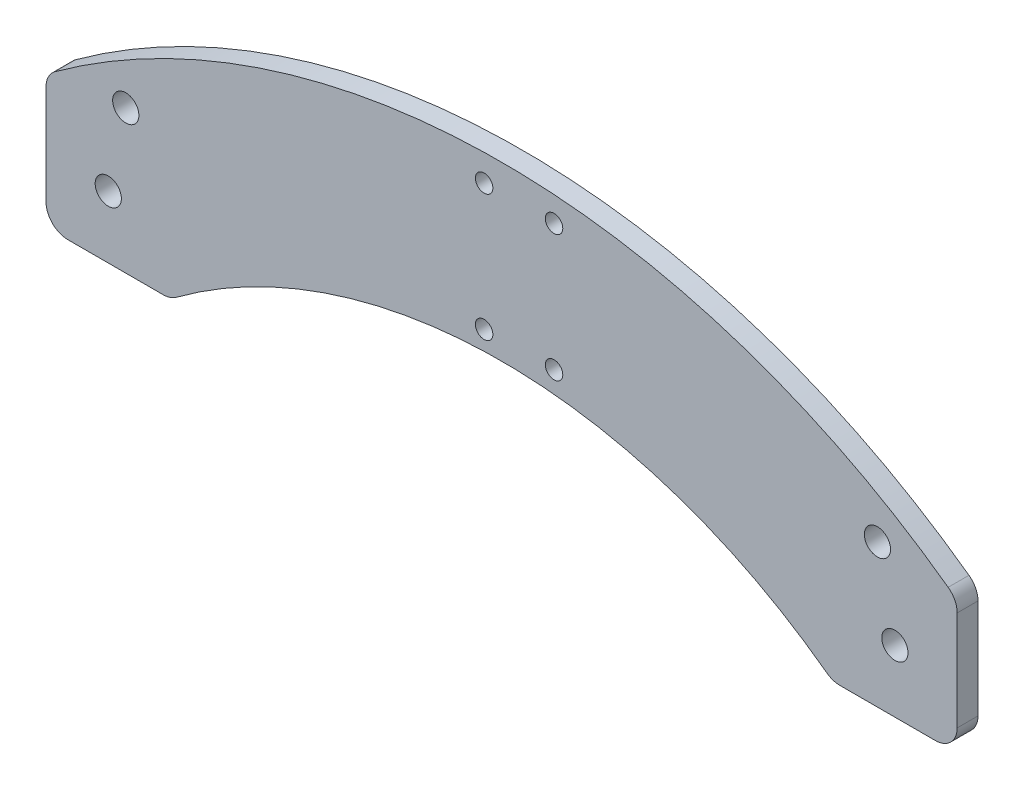
ISO-10303-21;
HEADER;
FILE_DESCRIPTION(('STEP AP214'),'2;1');
FILE_NAME('part.step','',(''),(''),'','','');
FILE_SCHEMA(('AUTOMOTIVE_DESIGN { 1 0 10303 214 1 1 1 1 }'));
ENDSEC;
DATA;
#1=APPLICATION_CONTEXT('core data for automotive mechanical design processes');
#2=APPLICATION_PROTOCOL_DEFINITION('international standard','automotive_design',2000,#1);
#3=PRODUCT_CONTEXT('',#1,'mechanical');
#4=PRODUCT('Part','Part','',(#3));
#5=PRODUCT_RELATED_PRODUCT_CATEGORY('part','',(#4));
#6=PRODUCT_DEFINITION_FORMATION('','',#4);
#7=PRODUCT_DEFINITION_CONTEXT('part definition',#1,'design');
#8=PRODUCT_DEFINITION('design','',#6,#7);
#9=PRODUCT_DEFINITION_SHAPE('','',#8);
#10=(LENGTH_UNIT() NAMED_UNIT(*) SI_UNIT(.MILLI.,.METRE.));
#11=(NAMED_UNIT(*) PLANE_ANGLE_UNIT() SI_UNIT($,.RADIAN.));
#12=(NAMED_UNIT(*) SI_UNIT($,.STERADIAN.) SOLID_ANGLE_UNIT());
#13=UNCERTAINTY_MEASURE_WITH_UNIT(LENGTH_MEASURE(1.E-05),#10,'distance_accuracy_value','');
#14=(GEOMETRIC_REPRESENTATION_CONTEXT(3) GLOBAL_UNCERTAINTY_ASSIGNED_CONTEXT((#13)) GLOBAL_UNIT_ASSIGNED_CONTEXT((#10,
#11,#12)) REPRESENTATION_CONTEXT('',''));
#15=CARTESIAN_POINT('',(0.,0.,0.));
#16=DIRECTION('',(0.,0.,1.));
#17=DIRECTION('',(1.,0.,0.));
#18=AXIS2_PLACEMENT_3D('',#15,#16,#17);
#19=CARTESIAN_POINT('',(-9.24999999999999,13.5361012676361,4.7625));
#20=DIRECTION('',(0.,0.,1.));
#21=DIRECTION('',(1.,0.,0.));
#22=AXIS2_PLACEMENT_3D('',#19,#20,#21);
#23=PLANE('',#22);
#24=CARTESIAN_POINT('',(4.,18.5000000000001,4.7625));
#25=DIRECTION('',(0.,0.,1.));
#26=DIRECTION('',(1.,0.,0.));
#27=AXIS2_PLACEMENT_3D('',#24,#25,#26);
#28=CIRCLE('',#27,3.00000000000229);
#29=CARTESIAN_POINT('',(7.00000000000228,18.5000000000001,4.7625));
#30=VERTEX_POINT('',#29);
#31=EDGE_CURVE('E308',#30,#30,#28,.T.);
#32=ORIENTED_EDGE('',*,*,#31,.F.);
#33=EDGE_LOOP('',(#32));
#34=FACE_BOUND('',#33,.T.);
#35=CARTESIAN_POINT('',(180.,2.10499963540171E-13,4.7625));
#36=DIRECTION('',(0.,0.,1.));
#37=DIRECTION('',(1.,0.,0.));
#38=AXIS2_PLACEMENT_3D('',#35,#36,#37);
#39=CIRCLE('',#38,3.00000000000018);
#40=CARTESIAN_POINT('',(183.,2.10499963540171E-13,4.7625));
#41=VERTEX_POINT('',#40);
#42=EDGE_CURVE('E320',#41,#41,#39,.T.);
#43=ORIENTED_EDGE('',*,*,#42,.F.);
#44=EDGE_LOOP('',(#43));
#45=FACE_BOUND('',#44,.T.);
#46=CARTESIAN_POINT('',(102.,44.6000000000001,4.7625));
#47=DIRECTION('',(0.,0.,1.));
#48=DIRECTION('',(1.,0.,0.));
#49=AXIS2_PLACEMENT_3D('',#46,#47,#48);
#50=CIRCLE('',#49,2.);
#51=CARTESIAN_POINT('',(104.,44.6000000000001,4.7625));
#52=VERTEX_POINT('',#51);
#53=EDGE_CURVE('E332',#52,#52,#50,.T.);
#54=ORIENTED_EDGE('',*,*,#53,.F.);
#55=EDGE_LOOP('',(#54));
#56=FACE_BOUND('',#55,.T.);
#57=CARTESIAN_POINT('',(86.,44.6000000000001,4.7625));
#58=DIRECTION('',(0.,0.,1.));
#59=DIRECTION('',(1.,0.,0.));
#60=AXIS2_PLACEMENT_3D('',#57,#58,#59);
#61=CIRCLE('',#60,2.);
#62=CARTESIAN_POINT('',(88.,44.6000000000001,4.7625));
#63=VERTEX_POINT('',#62);
#64=EDGE_CURVE('E158',#63,#63,#61,.T.);
#65=ORIENTED_EDGE('',*,*,#64,.F.);
#66=EDGE_LOOP('',(#65));
#67=FACE_BOUND('',#66,.T.);
#68=CARTESIAN_POINT('',(-9.24999999999999,13.5361012676361,4.7625));
#69=DIRECTION('',(0.,0.,1.));
#70=DIRECTION('',(1.,0.,0.));
#71=AXIS2_PLACEMENT_3D('',#68,#69,#70);
#72=CIRCLE('',#71,5.);
#73=CARTESIAN_POINT('',(-12.1863905325444,17.5830273406431,4.7625));
#74=VERTEX_POINT('',#73);
#75=CARTESIAN_POINT('',(-14.25,13.5361012676361,4.7625));
#76=VERTEX_POINT('',#75);
#77=EDGE_CURVE('E177',#74,#76,#72,.T.);
#78=ORIENTED_EDGE('',*,*,#77,.T.);
#79=DIRECTION('',(0.,-1.,0.));
#80=VECTOR('',#79,1.);
#81=CARTESIAN_POINT('',(-14.25,-9.24999999999996,4.7625));
#82=LINE('',#81,#80);
#83=CARTESIAN_POINT('',(-14.25,-9.24999999999996,4.7625));
#84=VERTEX_POINT('',#83);
#85=EDGE_CURVE('E105',#76,#84,#82,.T.);
#86=ORIENTED_EDGE('',*,*,#85,.T.);
#87=CARTESIAN_POINT('',(-9.24999999999999,-9.24999999999996,4.7625));
#88=DIRECTION('',(0.,0.,1.));
#89=DIRECTION('',(1.,0.,0.));
#90=AXIS2_PLACEMENT_3D('',#87,#88,#89);
#91=CIRCLE('',#90,5.);
#92=CARTESIAN_POINT('',(-9.24999999999999,-14.25,4.7625));
#93=VERTEX_POINT('',#92);
#94=EDGE_CURVE('E204',#84,#93,#91,.T.);
#95=ORIENTED_EDGE('',*,*,#94,.T.);
#96=DIRECTION('',(1.,0.,0.));
#97=VECTOR('',#96,1.);
#98=CARTESIAN_POINT('',(12.5808053846766,-14.25,4.7625));
#99=LINE('',#98,#97);
#100=CARTESIAN_POINT('',(12.5808053846766,-14.25,4.7625));
#101=VERTEX_POINT('',#100);
#102=EDGE_CURVE('E223',#93,#101,#99,.T.);
#103=ORIENTED_EDGE('',*,*,#102,.T.);
#104=CARTESIAN_POINT('',(12.5808053846766,-9.24999999999995,4.7625));
#105=DIRECTION('',(0.,0.,1.));
#106=DIRECTION('',(-1.,0.,0.));
#107=AXIS2_PLACEMENT_3D('',#104,#105,#106);
#108=CIRCLE('',#107,5.00000000000001);
#109=CARTESIAN_POINT('',(15.5584667160352,-13.2666569427487,4.7625));
#110=VERTEX_POINT('',#109);
#111=EDGE_CURVE('E220',#101,#110,#108,.T.);
#112=ORIENTED_EDGE('',*,*,#111,.T.);
#113=CARTESIAN_POINT('',(90.0000000000001,-113.683080511467,4.7625));
#114=DIRECTION('',(0.,0.,-1.));
#115=DIRECTION('',(1.,0.,0.));
#116=AXIS2_PLACEMENT_3D('',#113,#114,#115);
#117=CIRCLE('',#116,125.);
#118=CARTESIAN_POINT('',(164.441533283965,-13.2666569427486,4.7625));
#119=VERTEX_POINT('',#118);
#120=EDGE_CURVE('E222',#110,#119,#117,.T.);
#121=ORIENTED_EDGE('',*,*,#120,.T.);
#122=CARTESIAN_POINT('',(167.419194615324,-9.24999999999983,4.7625));
#123=DIRECTION('',(0.,0.,1.));
#124=DIRECTION('',(-1.,0.,0.));
#125=AXIS2_PLACEMENT_3D('',#122,#123,#124);
#126=CIRCLE('',#125,5.00000000000001);
#127=CARTESIAN_POINT('',(167.419194615324,-14.2499999999998,4.7625));
#128=VERTEX_POINT('',#127);
#129=EDGE_CURVE('E225',#119,#128,#126,.T.);
#130=ORIENTED_EDGE('',*,*,#129,.T.);
#131=DIRECTION('',(1.,0.,0.));
#132=VECTOR('',#131,1.);
#133=CARTESIAN_POINT('',(189.25,-14.2499999999998,4.7625));
#134=LINE('',#133,#132);
#135=CARTESIAN_POINT('',(189.25,-14.2499999999998,4.7625));
#136=VERTEX_POINT('',#135);
#137=EDGE_CURVE('E231',#128,#136,#134,.T.);
#138=ORIENTED_EDGE('',*,*,#137,.T.);
#139=CARTESIAN_POINT('',(189.25,-9.24999999999983,4.7625));
#140=DIRECTION('',(0.,0.,1.));
#141=DIRECTION('',(-1.,0.,0.));
#142=AXIS2_PLACEMENT_3D('',#139,#140,#141);
#143=CIRCLE('',#142,5.);
#144=CARTESIAN_POINT('',(194.25,-9.24999999999983,4.7625));
#145=VERTEX_POINT('',#144);
#146=EDGE_CURVE('E136',#136,#145,#143,.T.);
#147=ORIENTED_EDGE('',*,*,#146,.T.);
#148=DIRECTION('',(0.,1.,0.));
#149=VECTOR('',#148,1.);
#150=CARTESIAN_POINT('',(194.25,13.5361012676362,4.7625));
#151=LINE('',#150,#149);
#152=CARTESIAN_POINT('',(194.25,13.5361012676362,4.7625));
#153=VERTEX_POINT('',#152);
#154=EDGE_CURVE('E130',#145,#153,#151,.T.);
#155=ORIENTED_EDGE('',*,*,#154,.T.);
#156=CARTESIAN_POINT('',(189.25,13.5361012676362,4.7625));
#157=DIRECTION('',(0.,0.,1.));
#158=DIRECTION('',(1.,0.,0.));
#159=AXIS2_PLACEMENT_3D('',#156,#157,#158);
#160=CIRCLE('',#159,5.);
#161=CARTESIAN_POINT('',(192.186390532544,17.5830273406432,4.7625));
#162=VERTEX_POINT('',#161);
#163=EDGE_CURVE('E134',#153,#162,#160,.T.);
#164=ORIENTED_EDGE('',*,*,#163,.T.);
#165=CARTESIAN_POINT('',(90.0000000000001,-123.25,4.7625));
#166=DIRECTION('',(0.,0.,1.));
#167=DIRECTION('',(-1.,0.,0.));
#168=AXIS2_PLACEMENT_3D('',#165,#166,#167);
#169=CIRCLE('',#168,174.);
#170=EDGE_CURVE('E50',#162,#74,#169,.T.);
#171=ORIENTED_EDGE('',*,*,#170,.T.);
#172=EDGE_LOOP('',(#78,#86,#95,#103,#112,#121,#130,#138,#147,#155,#164,#171));
#173=FACE_BOUND('',#172,.T.);
#174=CARTESIAN_POINT('',(86.,15.6000000000001,4.7625));
#175=DIRECTION('',(0.,0.,1.));
#176=DIRECTION('',(1.,0.,0.));
#177=AXIS2_PLACEMENT_3D('',#174,#175,#176);
#178=CIRCLE('',#177,2.);
#179=CARTESIAN_POINT('',(88.,15.6000000000001,4.7625));
#180=VERTEX_POINT('',#179);
#181=EDGE_CURVE('E338',#180,#180,#178,.T.);
#182=ORIENTED_EDGE('',*,*,#181,.F.);
#183=EDGE_LOOP('',(#182));
#184=FACE_BOUND('',#183,.T.);
#185=CARTESIAN_POINT('',(102.,15.6000000000001,4.7625));
#186=DIRECTION('',(0.,0.,1.));
#187=DIRECTION('',(1.,0.,0.));
#188=AXIS2_PLACEMENT_3D('',#185,#186,#187);
#189=CIRCLE('',#188,2.);
#190=CARTESIAN_POINT('',(104.,15.6000000000001,4.7625));
#191=VERTEX_POINT('',#190);
#192=EDGE_CURVE('E326',#191,#191,#189,.T.);
#193=ORIENTED_EDGE('',*,*,#192,.F.);
#194=EDGE_LOOP('',(#193));
#195=FACE_BOUND('',#194,.T.);
#196=CARTESIAN_POINT('',(0.,0.,4.7625));
#197=DIRECTION('',(0.,0.,1.));
#198=DIRECTION('',(1.,0.,0.));
#199=AXIS2_PLACEMENT_3D('',#196,#197,#198);
#200=CIRCLE('',#199,3.);
#201=CARTESIAN_POINT('',(3.,0.,4.7625));
#202=VERTEX_POINT('',#201);
#203=EDGE_CURVE('E314',#202,#202,#200,.T.);
#204=ORIENTED_EDGE('',*,*,#203,.F.);
#205=EDGE_LOOP('',(#204));
#206=FACE_BOUND('',#205,.T.);
#207=CARTESIAN_POINT('',(176.,18.5000000000002,4.7625));
#208=DIRECTION('',(0.,0.,1.));
#209=DIRECTION('',(1.,0.,0.));
#210=AXIS2_PLACEMENT_3D('',#207,#208,#209);
#211=CIRCLE('',#210,2.99999999999999);
#212=CARTESIAN_POINT('',(179.,18.5000000000002,4.7625));
#213=VERTEX_POINT('',#212);
#214=EDGE_CURVE('E299',#213,#213,#211,.T.);
#215=ORIENTED_EDGE('',*,*,#214,.F.);
#216=EDGE_LOOP('',(#215));
#217=FACE_BOUND('',#216,.T.);
#218=ADVANCED_FACE('F33',(#34,#45,#56,#67,#173,#184,#195,#206,#217),#23,.T.);
#219=CARTESIAN_POINT('',(-9.24999999999999,13.5361012676361,0.));
#220=DIRECTION('',(0.,0.,1.));
#221=DIRECTION('',(1.,0.,0.));
#222=AXIS2_PLACEMENT_3D('',#219,#220,#221);
#223=PLANE('',#222);
#224=CARTESIAN_POINT('',(4.,18.5000000000001,0.));
#225=DIRECTION('',(0.,0.,1.));
#226=DIRECTION('',(1.,0.,0.));
#227=AXIS2_PLACEMENT_3D('',#224,#225,#226);
#228=CIRCLE('',#227,3.00000000000229);
#229=CARTESIAN_POINT('',(7.00000000000228,18.5000000000001,0.));
#230=VERTEX_POINT('',#229);
#231=EDGE_CURVE('E305',#230,#230,#228,.T.);
#232=ORIENTED_EDGE('',*,*,#231,.T.);
#233=EDGE_LOOP('',(#232));
#234=FACE_BOUND('',#233,.T.);
#235=CARTESIAN_POINT('',(180.,2.10499963540171E-13,0.));
#236=DIRECTION('',(0.,0.,1.));
#237=DIRECTION('',(1.,0.,0.));
#238=AXIS2_PLACEMENT_3D('',#235,#236,#237);
#239=CIRCLE('',#238,3.00000000000018);
#240=CARTESIAN_POINT('',(183.,2.10499963540171E-13,0.));
#241=VERTEX_POINT('',#240);
#242=EDGE_CURVE('E317',#241,#241,#239,.T.);
#243=ORIENTED_EDGE('',*,*,#242,.T.);
#244=EDGE_LOOP('',(#243));
#245=FACE_BOUND('',#244,.T.);
#246=CARTESIAN_POINT('',(102.,44.6000000000001,0.));
#247=DIRECTION('',(0.,0.,1.));
#248=DIRECTION('',(1.,0.,0.));
#249=AXIS2_PLACEMENT_3D('',#246,#247,#248);
#250=CIRCLE('',#249,2.);
#251=CARTESIAN_POINT('',(104.,44.6000000000001,0.));
#252=VERTEX_POINT('',#251);
#253=EDGE_CURVE('E329',#252,#252,#250,.T.);
#254=ORIENTED_EDGE('',*,*,#253,.T.);
#255=EDGE_LOOP('',(#254));
#256=FACE_BOUND('',#255,.T.);
#257=CARTESIAN_POINT('',(86.,44.6000000000001,0.));
#258=DIRECTION('',(0.,0.,1.));
#259=DIRECTION('',(1.,0.,0.));
#260=AXIS2_PLACEMENT_3D('',#257,#258,#259);
#261=CIRCLE('',#260,2.);
#262=CARTESIAN_POINT('',(88.,44.6000000000001,0.));
#263=VERTEX_POINT('',#262);
#264=EDGE_CURVE('E341',#263,#263,#261,.T.);
#265=ORIENTED_EDGE('',*,*,#264,.T.);
#266=EDGE_LOOP('',(#265));
#267=FACE_BOUND('',#266,.T.);
#268=CARTESIAN_POINT('',(-9.24999999999999,13.5361012676361,0.));
#269=DIRECTION('',(0.,0.,1.));
#270=DIRECTION('',(1.,0.,0.));
#271=AXIS2_PLACEMENT_3D('',#268,#269,#270);
#272=CIRCLE('',#271,5.);
#273=CARTESIAN_POINT('',(-12.1863905325444,17.5830273406431,0.));
#274=VERTEX_POINT('',#273);
#275=CARTESIAN_POINT('',(-14.25,13.5361012676361,0.));
#276=VERTEX_POINT('',#275);
#277=EDGE_CURVE('E154',#274,#276,#272,.T.);
#278=ORIENTED_EDGE('',*,*,#277,.F.);
#279=CARTESIAN_POINT('',(90.0000000000001,-123.25,0.));
#280=DIRECTION('',(0.,0.,1.));
#281=DIRECTION('',(-1.,0.,0.));
#282=AXIS2_PLACEMENT_3D('',#279,#280,#281);
#283=CIRCLE('',#282,174.);
#284=CARTESIAN_POINT('',(192.186390532544,17.5830273406432,0.));
#285=VERTEX_POINT('',#284);
#286=EDGE_CURVE('E97',#285,#274,#283,.T.);
#287=ORIENTED_EDGE('',*,*,#286,.F.);
#288=CARTESIAN_POINT('',(189.25,13.5361012676362,0.));
#289=DIRECTION('',(0.,0.,1.));
#290=DIRECTION('',(1.,0.,0.));
#291=AXIS2_PLACEMENT_3D('',#288,#289,#290);
#292=CIRCLE('',#291,5.);
#293=CARTESIAN_POINT('',(194.25,13.5361012676362,0.));
#294=VERTEX_POINT('',#293);
#295=EDGE_CURVE('E91',#294,#285,#292,.T.);
#296=ORIENTED_EDGE('',*,*,#295,.F.);
#297=DIRECTION('',(0.,1.,0.));
#298=VECTOR('',#297,1.);
#299=CARTESIAN_POINT('',(194.25,13.5361012676362,0.));
#300=LINE('',#299,#298);
#301=CARTESIAN_POINT('',(194.25,-9.24999999999983,0.));
#302=VERTEX_POINT('',#301);
#303=EDGE_CURVE('E144',#302,#294,#300,.T.);
#304=ORIENTED_EDGE('',*,*,#303,.F.);
#305=CARTESIAN_POINT('',(189.25,-9.24999999999983,0.));
#306=DIRECTION('',(0.,0.,1.));
#307=DIRECTION('',(-1.,0.,0.));
#308=AXIS2_PLACEMENT_3D('',#305,#306,#307);
#309=CIRCLE('',#308,5.);
#310=CARTESIAN_POINT('',(189.25,-14.2499999999998,0.));
#311=VERTEX_POINT('',#310);
#312=EDGE_CURVE('E172',#311,#302,#309,.T.);
#313=ORIENTED_EDGE('',*,*,#312,.F.);
#314=DIRECTION('',(1.,0.,0.));
#315=VECTOR('',#314,1.);
#316=CARTESIAN_POINT('',(189.25,-14.2499999999998,0.));
#317=LINE('',#316,#315);
#318=CARTESIAN_POINT('',(167.419194615324,-14.2499999999998,0.));
#319=VERTEX_POINT('',#318);
#320=EDGE_CURVE('E170',#319,#311,#317,.T.);
#321=ORIENTED_EDGE('',*,*,#320,.F.);
#322=CARTESIAN_POINT('',(167.419194615324,-9.24999999999983,0.));
#323=DIRECTION('',(0.,0.,1.));
#324=DIRECTION('',(-1.,0.,0.));
#325=AXIS2_PLACEMENT_3D('',#322,#323,#324);
#326=CIRCLE('',#325,5.00000000000001);
#327=CARTESIAN_POINT('',(164.441533283965,-13.2666569427486,0.));
#328=VERTEX_POINT('',#327);
#329=EDGE_CURVE('E168',#328,#319,#326,.T.);
#330=ORIENTED_EDGE('',*,*,#329,.F.);
#331=CARTESIAN_POINT('',(90.0000000000001,-113.683080511467,0.));
#332=DIRECTION('',(0.,0.,-1.));
#333=DIRECTION('',(1.,0.,0.));
#334=AXIS2_PLACEMENT_3D('',#331,#332,#333);
#335=CIRCLE('',#334,125.);
#336=CARTESIAN_POINT('',(15.5584667160352,-13.2666569427487,0.));
#337=VERTEX_POINT('',#336);
#338=EDGE_CURVE('E166',#337,#328,#335,.T.);
#339=ORIENTED_EDGE('',*,*,#338,.F.);
#340=CARTESIAN_POINT('',(12.5808053846766,-9.24999999999995,0.));
#341=DIRECTION('',(0.,0.,1.));
#342=DIRECTION('',(-1.,0.,0.));
#343=AXIS2_PLACEMENT_3D('',#340,#341,#342);
#344=CIRCLE('',#343,5.00000000000001);
#345=CARTESIAN_POINT('',(12.5808053846766,-14.25,0.));
#346=VERTEX_POINT('',#345);
#347=EDGE_CURVE('E164',#346,#337,#344,.T.);
#348=ORIENTED_EDGE('',*,*,#347,.F.);
#349=DIRECTION('',(1.,0.,0.));
#350=VECTOR('',#349,1.);
#351=CARTESIAN_POINT('',(12.5808053846766,-14.25,0.));
#352=LINE('',#351,#350);
#353=CARTESIAN_POINT('',(-9.24999999999999,-14.25,0.));
#354=VERTEX_POINT('',#353);
#355=EDGE_CURVE('E162',#354,#346,#352,.T.);
#356=ORIENTED_EDGE('',*,*,#355,.F.);
#357=CARTESIAN_POINT('',(-9.24999999999999,-9.24999999999996,0.));
#358=DIRECTION('',(0.,0.,1.));
#359=DIRECTION('',(1.,0.,0.));
#360=AXIS2_PLACEMENT_3D('',#357,#358,#359);
#361=CIRCLE('',#360,5.);
#362=CARTESIAN_POINT('',(-14.25,-9.24999999999996,0.));
#363=VERTEX_POINT('',#362);
#364=EDGE_CURVE('E160',#363,#354,#361,.T.);
#365=ORIENTED_EDGE('',*,*,#364,.F.);
#366=DIRECTION('',(0.,-1.,0.));
#367=VECTOR('',#366,1.);
#368=CARTESIAN_POINT('',(-14.25,-9.24999999999996,0.));
#369=LINE('',#368,#367);
#370=EDGE_CURVE('E157',#276,#363,#369,.T.);
#371=ORIENTED_EDGE('',*,*,#370,.F.);
#372=EDGE_LOOP('',(#278,#287,#296,#304,#313,#321,#330,#339,#348,#356,#365,#371));
#373=FACE_BOUND('',#372,.T.);
#374=CARTESIAN_POINT('',(86.,15.6000000000001,0.));
#375=DIRECTION('',(0.,0.,1.));
#376=DIRECTION('',(1.,0.,0.));
#377=AXIS2_PLACEMENT_3D('',#374,#375,#376);
#378=CIRCLE('',#377,2.);
#379=CARTESIAN_POINT('',(88.,15.6000000000001,0.));
#380=VERTEX_POINT('',#379);
#381=EDGE_CURVE('E335',#380,#380,#378,.T.);
#382=ORIENTED_EDGE('',*,*,#381,.T.);
#383=EDGE_LOOP('',(#382));
#384=FACE_BOUND('',#383,.T.);
#385=CARTESIAN_POINT('',(102.,15.6000000000001,0.));
#386=DIRECTION('',(0.,0.,1.));
#387=DIRECTION('',(1.,0.,0.));
#388=AXIS2_PLACEMENT_3D('',#385,#386,#387);
#389=CIRCLE('',#388,2.);
#390=CARTESIAN_POINT('',(104.,15.6000000000001,0.));
#391=VERTEX_POINT('',#390);
#392=EDGE_CURVE('E323',#391,#391,#389,.T.);
#393=ORIENTED_EDGE('',*,*,#392,.T.);
#394=EDGE_LOOP('',(#393));
#395=FACE_BOUND('',#394,.T.);
#396=CARTESIAN_POINT('',(0.,0.,0.));
#397=DIRECTION('',(0.,0.,1.));
#398=DIRECTION('',(1.,0.,0.));
#399=AXIS2_PLACEMENT_3D('',#396,#397,#398);
#400=CIRCLE('',#399,3.);
#401=CARTESIAN_POINT('',(3.,0.,0.));
#402=VERTEX_POINT('',#401);
#403=EDGE_CURVE('E311',#402,#402,#400,.T.);
#404=ORIENTED_EDGE('',*,*,#403,.T.);
#405=EDGE_LOOP('',(#404));
#406=FACE_BOUND('',#405,.T.);
#407=CARTESIAN_POINT('',(176.,18.5000000000002,0.));
#408=DIRECTION('',(0.,0.,1.));
#409=DIRECTION('',(1.,0.,0.));
#410=AXIS2_PLACEMENT_3D('',#407,#408,#409);
#411=CIRCLE('',#410,2.99999999999999);
#412=CARTESIAN_POINT('',(179.,18.5000000000002,0.));
#413=VERTEX_POINT('',#412);
#414=EDGE_CURVE('E302',#413,#413,#411,.T.);
#415=ORIENTED_EDGE('',*,*,#414,.T.);
#416=EDGE_LOOP('',(#415));
#417=FACE_BOUND('',#416,.T.);
#418=ADVANCED_FACE('F208',(#234,#245,#256,#267,#373,#384,#395,#406,#417),#223,.F.);
#419=CARTESIAN_POINT('',(-9.24999999999999,13.5361012676361,4.7625));
#420=DIRECTION('',(0.,0.,-1.));
#421=DIRECTION('',(-1.,0.,0.));
#422=AXIS2_PLACEMENT_3D('',#419,#420,#421);
#423=CYLINDRICAL_SURFACE('',#422,5.);
#424=ORIENTED_EDGE('',*,*,#277,.T.);
#425=DIRECTION('',(0.,0.,-1.));
#426=VECTOR('',#425,1.);
#427=CARTESIAN_POINT('',(-14.25,13.5361012676361,4.7625));
#428=LINE('',#427,#426);
#429=EDGE_CURVE('E11',#76,#276,#428,.T.);
#430=ORIENTED_EDGE('',*,*,#429,.F.);
#431=ORIENTED_EDGE('',*,*,#77,.F.);
#432=DIRECTION('',(0.,0.,-1.));
#433=VECTOR('',#432,1.);
#434=CARTESIAN_POINT('',(-12.1863905325444,17.5830273406431,4.7625));
#435=LINE('',#434,#433);
#436=EDGE_CURVE('E150',#74,#274,#435,.T.);
#437=ORIENTED_EDGE('',*,*,#436,.T.);
#438=EDGE_LOOP('',(#424,#430,#431,#437));
#439=FACE_BOUND('',#438,.T.);
#440=ADVANCED_FACE('F35',(#439),#423,.T.);
#441=CARTESIAN_POINT('',(-14.25,-9.24999999999996,4.7625));
#442=DIRECTION('',(1.,0.,0.));
#443=DIRECTION('',(0.,1.,0.));
#444=AXIS2_PLACEMENT_3D('',#441,#442,#443);
#445=PLANE('',#444);
#446=ORIENTED_EDGE('',*,*,#370,.T.);
#447=DIRECTION('',(0.,0.,-1.));
#448=VECTOR('',#447,1.);
#449=CARTESIAN_POINT('',(-14.25,-9.24999999999996,4.7625));
#450=LINE('',#449,#448);
#451=EDGE_CURVE('E42',#84,#363,#450,.T.);
#452=ORIENTED_EDGE('',*,*,#451,.F.);
#453=ORIENTED_EDGE('',*,*,#85,.F.);
#454=ORIENTED_EDGE('',*,*,#429,.T.);
#455=EDGE_LOOP('',(#446,#452,#453,#454));
#456=FACE_BOUND('',#455,.T.);
#457=ADVANCED_FACE('F486',(#456),#445,.F.);
#458=CARTESIAN_POINT('',(-9.24999999999999,-9.24999999999996,4.7625));
#459=DIRECTION('',(0.,0.,-1.));
#460=DIRECTION('',(-1.,0.,0.));
#461=AXIS2_PLACEMENT_3D('',#458,#459,#460);
#462=CYLINDRICAL_SURFACE('',#461,5.);
#463=ORIENTED_EDGE('',*,*,#364,.T.);
#464=DIRECTION('',(0.,0.,-1.));
#465=VECTOR('',#464,1.);
#466=CARTESIAN_POINT('',(-9.24999999999999,-14.25,4.7625));
#467=LINE('',#466,#465);
#468=EDGE_CURVE('E196',#93,#354,#467,.T.);
#469=ORIENTED_EDGE('',*,*,#468,.F.);
#470=ORIENTED_EDGE('',*,*,#94,.F.);
#471=ORIENTED_EDGE('',*,*,#451,.T.);
#472=EDGE_LOOP('',(#463,#469,#470,#471));
#473=FACE_BOUND('',#472,.T.);
#474=ADVANCED_FACE('F202',(#473),#462,.T.);
#475=CARTESIAN_POINT('',(12.5808053846766,-14.25,4.7625));
#476=DIRECTION('',(0.,1.,0.));
#477=DIRECTION('',(-1.,0.,0.));
#478=AXIS2_PLACEMENT_3D('',#475,#476,#477);
#479=PLANE('',#478);
#480=ORIENTED_EDGE('',*,*,#355,.T.);
#481=DIRECTION('',(0.,0.,-1.));
#482=VECTOR('',#481,1.);
#483=CARTESIAN_POINT('',(12.5808053846766,-14.25,4.7625));
#484=LINE('',#483,#482);
#485=EDGE_CURVE('E193',#101,#346,#484,.T.);
#486=ORIENTED_EDGE('',*,*,#485,.F.);
#487=ORIENTED_EDGE('',*,*,#102,.F.);
#488=ORIENTED_EDGE('',*,*,#468,.T.);
#489=EDGE_LOOP('',(#480,#486,#487,#488));
#490=FACE_BOUND('',#489,.T.);
#491=ADVANCED_FACE('F214',(#490),#479,.F.);
#492=CARTESIAN_POINT('',(12.5808053846766,-9.24999999999995,4.7625));
#493=DIRECTION('',(0.,0.,-1.));
#494=DIRECTION('',(-1.,0.,0.));
#495=AXIS2_PLACEMENT_3D('',#492,#493,#494);
#496=CYLINDRICAL_SURFACE('',#495,5.00000000000001);
#497=ORIENTED_EDGE('',*,*,#347,.T.);
#498=DIRECTION('',(0.,0.,-1.));
#499=VECTOR('',#498,1.);
#500=CARTESIAN_POINT('',(15.5584667160352,-13.2666569427487,4.7625));
#501=LINE('',#500,#499);
#502=EDGE_CURVE('E190',#110,#337,#501,.T.);
#503=ORIENTED_EDGE('',*,*,#502,.F.);
#504=ORIENTED_EDGE('',*,*,#111,.F.);
#505=ORIENTED_EDGE('',*,*,#485,.T.);
#506=EDGE_LOOP('',(#497,#503,#504,#505));
#507=FACE_BOUND('',#506,.T.);
#508=ADVANCED_FACE('F218',(#507),#496,.T.);
#509=CARTESIAN_POINT('',(90.0000000000001,-113.683080511467,4.7625));
#510=DIRECTION('',(0.,0.,-1.));
#511=DIRECTION('',(-1.,0.,0.));
#512=AXIS2_PLACEMENT_3D('',#509,#510,#511);
#513=CYLINDRICAL_SURFACE('',#512,125.);
#514=ORIENTED_EDGE('',*,*,#338,.T.);
#515=DIRECTION('',(0.,0.,-1.));
#516=VECTOR('',#515,1.);
#517=CARTESIAN_POINT('',(164.441533283965,-13.2666569427486,4.7625));
#518=LINE('',#517,#516);
#519=EDGE_CURVE('E187',#119,#328,#518,.T.);
#520=ORIENTED_EDGE('',*,*,#519,.F.);
#521=ORIENTED_EDGE('',*,*,#120,.F.);
#522=ORIENTED_EDGE('',*,*,#502,.T.);
#523=EDGE_LOOP('',(#514,#520,#521,#522));
#524=FACE_BOUND('',#523,.T.);
#525=ADVANCED_FACE('F451',(#524),#513,.F.);
#526=CARTESIAN_POINT('',(167.419194615324,-9.24999999999983,4.7625));
#527=DIRECTION('',(0.,0.,-1.));
#528=DIRECTION('',(-1.,0.,0.));
#529=AXIS2_PLACEMENT_3D('',#526,#527,#528);
#530=CYLINDRICAL_SURFACE('',#529,5.00000000000001);
#531=ORIENTED_EDGE('',*,*,#329,.T.);
#532=DIRECTION('',(0.,0.,-1.));
#533=VECTOR('',#532,1.);
#534=CARTESIAN_POINT('',(167.419194615324,-14.2499999999998,4.7625));
#535=LINE('',#534,#533);
#536=EDGE_CURVE('E184',#128,#319,#535,.T.);
#537=ORIENTED_EDGE('',*,*,#536,.F.);
#538=ORIENTED_EDGE('',*,*,#129,.F.);
#539=ORIENTED_EDGE('',*,*,#519,.T.);
#540=EDGE_LOOP('',(#531,#537,#538,#539));
#541=FACE_BOUND('',#540,.T.);
#542=ADVANCED_FACE('F442',(#541),#530,.T.);
#543=CARTESIAN_POINT('',(189.25,-14.2499999999998,4.7625));
#544=DIRECTION('',(0.,1.,0.));
#545=DIRECTION('',(-1.,0.,0.));
#546=AXIS2_PLACEMENT_3D('',#543,#544,#545);
#547=PLANE('',#546);
#548=ORIENTED_EDGE('',*,*,#320,.T.);
#549=DIRECTION('',(0.,0.,-1.));
#550=VECTOR('',#549,1.);
#551=CARTESIAN_POINT('',(189.25,-14.2499999999998,4.7625));
#552=LINE('',#551,#550);
#553=EDGE_CURVE('E181',#136,#311,#552,.T.);
#554=ORIENTED_EDGE('',*,*,#553,.F.);
#555=ORIENTED_EDGE('',*,*,#137,.F.);
#556=ORIENTED_EDGE('',*,*,#536,.T.);
#557=EDGE_LOOP('',(#548,#554,#555,#556));
#558=FACE_BOUND('',#557,.T.);
#559=ADVANCED_FACE('F237',(#558),#547,.F.);
#560=CARTESIAN_POINT('',(189.25,-9.24999999999983,4.7625));
#561=DIRECTION('',(0.,0.,-1.));
#562=DIRECTION('',(-1.,0.,0.));
#563=AXIS2_PLACEMENT_3D('',#560,#561,#562);
#564=CYLINDRICAL_SURFACE('',#563,5.);
#565=ORIENTED_EDGE('',*,*,#312,.T.);
#566=DIRECTION('',(0.,0.,-1.));
#567=VECTOR('',#566,1.);
#568=CARTESIAN_POINT('',(194.25,-9.24999999999983,4.7625));
#569=LINE('',#568,#567);
#570=EDGE_CURVE('E145',#145,#302,#569,.T.);
#571=ORIENTED_EDGE('',*,*,#570,.F.);
#572=ORIENTED_EDGE('',*,*,#146,.F.);
#573=ORIENTED_EDGE('',*,*,#553,.T.);
#574=EDGE_LOOP('',(#565,#571,#572,#573));
#575=FACE_BOUND('',#574,.T.);
#576=ADVANCED_FACE('F241',(#575),#564,.T.);
#577=CARTESIAN_POINT('',(194.25,13.5361012676362,4.7625));
#578=DIRECTION('',(-1.,0.,0.));
#579=DIRECTION('',(0.,-1.,0.));
#580=AXIS2_PLACEMENT_3D('',#577,#578,#579);
#581=PLANE('',#580);
#582=ORIENTED_EDGE('',*,*,#303,.T.);
#583=DIRECTION('',(0.,0.,-1.));
#584=VECTOR('',#583,1.);
#585=CARTESIAN_POINT('',(194.25,13.5361012676362,4.7625));
#586=LINE('',#585,#584);
#587=EDGE_CURVE('E141',#153,#294,#586,.T.);
#588=ORIENTED_EDGE('',*,*,#587,.F.);
#589=ORIENTED_EDGE('',*,*,#154,.F.);
#590=ORIENTED_EDGE('',*,*,#570,.T.);
#591=EDGE_LOOP('',(#582,#588,#589,#590));
#592=FACE_BOUND('',#591,.T.);
#593=ADVANCED_FACE('F142',(#592),#581,.F.);
#594=CARTESIAN_POINT('',(189.25,13.5361012676362,4.7625));
#595=DIRECTION('',(0.,0.,-1.));
#596=DIRECTION('',(-1.,0.,0.));
#597=AXIS2_PLACEMENT_3D('',#594,#595,#596);
#598=CYLINDRICAL_SURFACE('',#597,5.);
#599=ORIENTED_EDGE('',*,*,#295,.T.);
#600=DIRECTION('',(0.,0.,-1.));
#601=VECTOR('',#600,1.);
#602=CARTESIAN_POINT('',(192.186390532544,17.5830273406432,4.7625));
#603=LINE('',#602,#601);
#604=EDGE_CURVE('E146',#162,#285,#603,.T.);
#605=ORIENTED_EDGE('',*,*,#604,.F.);
#606=ORIENTED_EDGE('',*,*,#163,.F.);
#607=ORIENTED_EDGE('',*,*,#587,.T.);
#608=EDGE_LOOP('',(#599,#605,#606,#607));
#609=FACE_BOUND('',#608,.T.);
#610=ADVANCED_FACE('F148',(#609),#598,.T.);
#611=CARTESIAN_POINT('',(90.0000000000001,-123.25,4.7625));
#612=DIRECTION('',(0.,0.,-1.));
#613=DIRECTION('',(-1.,0.,0.));
#614=AXIS2_PLACEMENT_3D('',#611,#612,#613);
#615=CYLINDRICAL_SURFACE('',#614,174.);
#616=ORIENTED_EDGE('',*,*,#286,.T.);
#617=ORIENTED_EDGE('',*,*,#436,.F.);
#618=ORIENTED_EDGE('',*,*,#170,.F.);
#619=ORIENTED_EDGE('',*,*,#604,.T.);
#620=EDGE_LOOP('',(#616,#617,#618,#619));
#621=FACE_BOUND('',#620,.T.);
#622=ADVANCED_FACE('F245',(#621),#615,.T.);
#623=CARTESIAN_POINT('',(86.,44.6000000000001,4.7625));
#624=DIRECTION('',(0.,0.,-1.));
#625=DIRECTION('',(-1.,0.,0.));
#626=AXIS2_PLACEMENT_3D('',#623,#624,#625);
#627=CYLINDRICAL_SURFACE('',#626,2.);
#628=ORIENTED_EDGE('',*,*,#64,.T.);
#629=EDGE_LOOP('',(#628));
#630=FACE_BOUND('',#629,.T.);
#631=ORIENTED_EDGE('',*,*,#264,.F.);
#632=EDGE_LOOP('',(#631));
#633=FACE_BOUND('',#632,.T.);
#634=ADVANCED_FACE('F247',(#630,#633),#627,.F.);
#635=CARTESIAN_POINT('',(86.,15.6000000000001,4.7625));
#636=DIRECTION('',(0.,0.,-1.));
#637=DIRECTION('',(-1.,0.,0.));
#638=AXIS2_PLACEMENT_3D('',#635,#636,#637);
#639=CYLINDRICAL_SURFACE('',#638,2.);
#640=ORIENTED_EDGE('',*,*,#181,.T.);
#641=EDGE_LOOP('',(#640));
#642=FACE_BOUND('',#641,.T.);
#643=ORIENTED_EDGE('',*,*,#381,.F.);
#644=EDGE_LOOP('',(#643));
#645=FACE_BOUND('',#644,.T.);
#646=ADVANCED_FACE('F253',(#642,#645),#639,.F.);
#647=CARTESIAN_POINT('',(102.,44.6000000000001,4.7625));
#648=DIRECTION('',(0.,0.,-1.));
#649=DIRECTION('',(-1.,0.,0.));
#650=AXIS2_PLACEMENT_3D('',#647,#648,#649);
#651=CYLINDRICAL_SURFACE('',#650,2.);
#652=ORIENTED_EDGE('',*,*,#53,.T.);
#653=EDGE_LOOP('',(#652));
#654=FACE_BOUND('',#653,.T.);
#655=ORIENTED_EDGE('',*,*,#253,.F.);
#656=EDGE_LOOP('',(#655));
#657=FACE_BOUND('',#656,.T.);
#658=ADVANCED_FACE('F270',(#654,#657),#651,.F.);
#659=CARTESIAN_POINT('',(102.,15.6000000000001,4.7625));
#660=DIRECTION('',(0.,0.,-1.));
#661=DIRECTION('',(-1.,0.,0.));
#662=AXIS2_PLACEMENT_3D('',#659,#660,#661);
#663=CYLINDRICAL_SURFACE('',#662,2.);
#664=ORIENTED_EDGE('',*,*,#192,.T.);
#665=EDGE_LOOP('',(#664));
#666=FACE_BOUND('',#665,.T.);
#667=ORIENTED_EDGE('',*,*,#392,.F.);
#668=EDGE_LOOP('',(#667));
#669=FACE_BOUND('',#668,.T.);
#670=ADVANCED_FACE('F274',(#666,#669),#663,.F.);
#671=CARTESIAN_POINT('',(180.,2.10499963540171E-13,4.7625));
#672=DIRECTION('',(0.,0.,-1.));
#673=DIRECTION('',(-1.,0.,0.));
#674=AXIS2_PLACEMENT_3D('',#671,#672,#673);
#675=CYLINDRICAL_SURFACE('',#674,3.00000000000018);
#676=ORIENTED_EDGE('',*,*,#42,.T.);
#677=EDGE_LOOP('',(#676));
#678=FACE_BOUND('',#677,.T.);
#679=ORIENTED_EDGE('',*,*,#242,.F.);
#680=EDGE_LOOP('',(#679));
#681=FACE_BOUND('',#680,.T.);
#682=ADVANCED_FACE('F278',(#678,#681),#675,.F.);
#683=CARTESIAN_POINT('',(0.,0.,4.7625));
#684=DIRECTION('',(0.,0.,-1.));
#685=DIRECTION('',(-1.,0.,0.));
#686=AXIS2_PLACEMENT_3D('',#683,#684,#685);
#687=CYLINDRICAL_SURFACE('',#686,3.);
#688=ORIENTED_EDGE('',*,*,#203,.T.);
#689=EDGE_LOOP('',(#688));
#690=FACE_BOUND('',#689,.T.);
#691=ORIENTED_EDGE('',*,*,#403,.F.);
#692=EDGE_LOOP('',(#691));
#693=FACE_BOUND('',#692,.T.);
#694=ADVANCED_FACE('F282',(#690,#693),#687,.F.);
#695=CARTESIAN_POINT('',(4.,18.5000000000001,4.7625));
#696=DIRECTION('',(0.,0.,-1.));
#697=DIRECTION('',(-1.,0.,0.));
#698=AXIS2_PLACEMENT_3D('',#695,#696,#697);
#699=CYLINDRICAL_SURFACE('',#698,3.00000000000229);
#700=ORIENTED_EDGE('',*,*,#31,.T.);
#701=EDGE_LOOP('',(#700));
#702=FACE_BOUND('',#701,.T.);
#703=ORIENTED_EDGE('',*,*,#231,.F.);
#704=EDGE_LOOP('',(#703));
#705=FACE_BOUND('',#704,.T.);
#706=ADVANCED_FACE('F286',(#702,#705),#699,.F.);
#707=CARTESIAN_POINT('',(176.,18.5000000000002,4.7625));
#708=DIRECTION('',(0.,0.,-1.));
#709=DIRECTION('',(-1.,0.,0.));
#710=AXIS2_PLACEMENT_3D('',#707,#708,#709);
#711=CYLINDRICAL_SURFACE('',#710,2.99999999999999);
#712=ORIENTED_EDGE('',*,*,#214,.T.);
#713=EDGE_LOOP('',(#712));
#714=FACE_BOUND('',#713,.T.);
#715=ORIENTED_EDGE('',*,*,#414,.F.);
#716=EDGE_LOOP('',(#715));
#717=FACE_BOUND('',#716,.T.);
#718=ADVANCED_FACE('F290',(#714,#717),#711,.F.);
#719=CLOSED_SHELL('',(#218,#418,#440,#457,#474,#491,#508,#525,#542,#559,#576,#593,#610,#622,
#634,#646,#658,#670,#682,#694,#706,#718));
#720=MANIFOLD_SOLID_BREP('B2',#719);
#721=ADVANCED_BREP_SHAPE_REPRESENTATION('',(#18,#720),#14);
#722=SHAPE_DEFINITION_REPRESENTATION(#9,#721);
ENDSEC;
END-ISO-10303-21;
